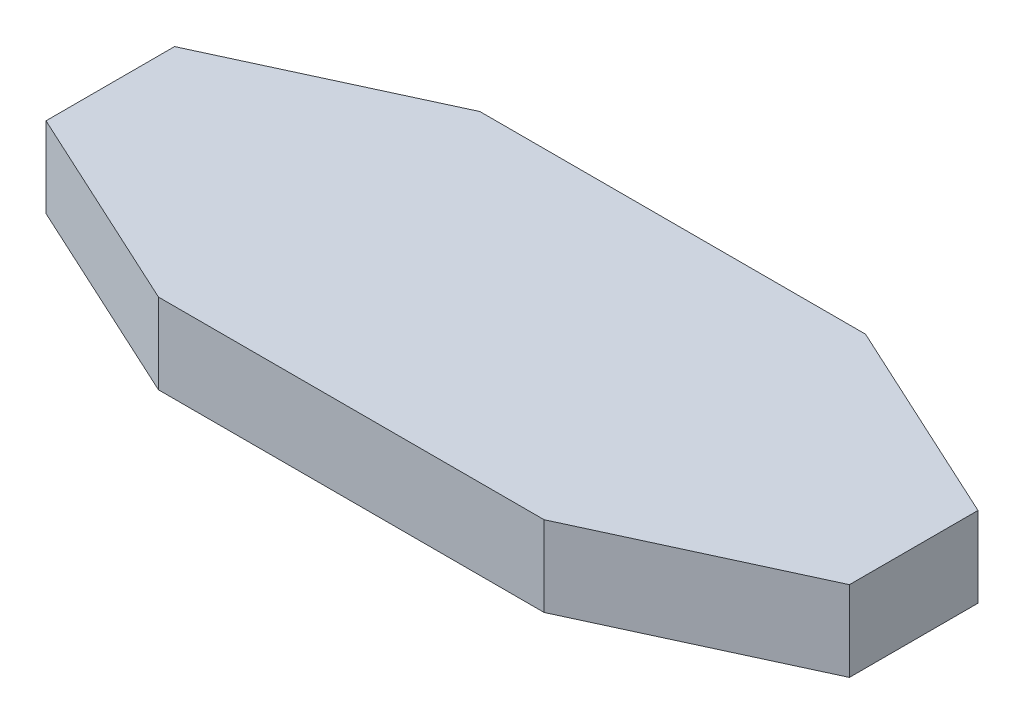
ISO-10303-21;
HEADER;
FILE_DESCRIPTION(('STEP AP214'),'2;1');
FILE_NAME('part.step','',(''),(''),'','','');
FILE_SCHEMA(('AUTOMOTIVE_DESIGN { 1 0 10303 214 1 1 1 1 }'));
ENDSEC;
DATA;
#1=APPLICATION_CONTEXT('core data for automotive mechanical design processes');
#2=APPLICATION_PROTOCOL_DEFINITION('international standard','automotive_design',2000,#1);
#3=PRODUCT_CONTEXT('',#1,'mechanical');
#4=PRODUCT('Part','Part','',(#3));
#5=PRODUCT_RELATED_PRODUCT_CATEGORY('part','',(#4));
#6=PRODUCT_DEFINITION_FORMATION('','',#4);
#7=PRODUCT_DEFINITION_CONTEXT('part definition',#1,'design');
#8=PRODUCT_DEFINITION('design','',#6,#7);
#9=PRODUCT_DEFINITION_SHAPE('','',#8);
#10=(LENGTH_UNIT() NAMED_UNIT(*) SI_UNIT(.MILLI.,.METRE.));
#11=(NAMED_UNIT(*) PLANE_ANGLE_UNIT() SI_UNIT($,.RADIAN.));
#12=(NAMED_UNIT(*) SI_UNIT($,.STERADIAN.) SOLID_ANGLE_UNIT());
#13=UNCERTAINTY_MEASURE_WITH_UNIT(LENGTH_MEASURE(1.E-05),#10,'distance_accuracy_value','');
#14=(GEOMETRIC_REPRESENTATION_CONTEXT(3) GLOBAL_UNCERTAINTY_ASSIGNED_CONTEXT((#13)) GLOBAL_UNIT_ASSIGNED_CONTEXT((#10,
#11,#12)) REPRESENTATION_CONTEXT('',''));
#15=CARTESIAN_POINT('',(0.,0.,0.));
#16=DIRECTION('',(0.,0.,1.));
#17=DIRECTION('',(1.,0.,0.));
#18=AXIS2_PLACEMENT_3D('',#15,#16,#17);
#19=CARTESIAN_POINT('',(-60.,25.,-50.));
#20=DIRECTION('',(0.,0.,-1.));
#21=DIRECTION('',(-1.,0.,0.));
#22=AXIS2_PLACEMENT_3D('',#19,#20,#21);
#23=PLANE('',#22);
#24=DIRECTION('',(1.,0.,0.));
#25=VECTOR('',#24,1.);
#26=CARTESIAN_POINT('',(-60.,0.,-50.));
#27=LINE('',#26,#25);
#28=CARTESIAN_POINT('',(-60.,0.,-50.));
#29=VERTEX_POINT('',#28);
#30=CARTESIAN_POINT('',(60.,0.,-50.));
#31=VERTEX_POINT('',#30);
#32=EDGE_CURVE('E144',#29,#31,#27,.T.);
#33=ORIENTED_EDGE('',*,*,#32,.F.);
#34=DIRECTION('',(0.,-1.,0.));
#35=VECTOR('',#34,1.);
#36=CARTESIAN_POINT('',(-60.,25.,-50.));
#37=LINE('',#36,#35);
#38=CARTESIAN_POINT('',(-60.,25.,-50.));
#39=VERTEX_POINT('',#38);
#40=EDGE_CURVE('E11',#39,#29,#37,.T.);
#41=ORIENTED_EDGE('',*,*,#40,.F.);
#42=DIRECTION('',(1.,0.,0.));
#43=VECTOR('',#42,1.);
#44=CARTESIAN_POINT('',(-60.,25.,-50.));
#45=LINE('',#44,#43);
#46=CARTESIAN_POINT('',(60.,25.,-50.));
#47=VERTEX_POINT('',#46);
#48=EDGE_CURVE('E170',#39,#47,#45,.T.);
#49=ORIENTED_EDGE('',*,*,#48,.T.);
#50=DIRECTION('',(0.,-1.,0.));
#51=VECTOR('',#50,1.);
#52=CARTESIAN_POINT('',(60.,25.,-50.));
#53=LINE('',#52,#51);
#54=EDGE_CURVE('E42',#47,#31,#53,.T.);
#55=ORIENTED_EDGE('',*,*,#54,.T.);
#56=EDGE_LOOP('',(#33,#41,#49,#55));
#57=FACE_BOUND('',#56,.T.);
#58=ADVANCED_FACE('F39',(#57),#23,.T.);
#59=CARTESIAN_POINT('',(-60.,25.,-50.));
#60=DIRECTION('',(0.419058177461748,0.,0.907959384500451));
#61=DIRECTION('',(0.907959384500451,0.,-0.419058177461748));
#62=AXIS2_PLACEMENT_3D('',#59,#60,#61);
#63=PLANE('',#62);
#64=DIRECTION('',(-0.907959384500451,0.,0.419058177461748));
#65=VECTOR('',#64,1.);
#66=CARTESIAN_POINT('',(-60.,0.,-50.));
#67=LINE('',#66,#65);
#68=CARTESIAN_POINT('',(-125.,0.,-19.9999999999999));
#69=VERTEX_POINT('',#68);
#70=EDGE_CURVE('E85',#29,#69,#67,.T.);
#71=ORIENTED_EDGE('',*,*,#70,.T.);
#72=DIRECTION('',(0.,-1.,0.));
#73=VECTOR('',#72,1.);
#74=CARTESIAN_POINT('',(-125.,25.,-19.9999999999999));
#75=LINE('',#74,#73);
#76=CARTESIAN_POINT('',(-125.,25.,-19.9999999999999));
#77=VERTEX_POINT('',#76);
#78=EDGE_CURVE('E49',#77,#69,#75,.T.);
#79=ORIENTED_EDGE('',*,*,#78,.F.);
#80=DIRECTION('',(-0.907959384500451,0.,0.419058177461748));
#81=VECTOR('',#80,1.);
#82=CARTESIAN_POINT('',(-60.,25.,-50.));
#83=LINE('',#82,#81);
#84=EDGE_CURVE('E117',#39,#77,#83,.T.);
#85=ORIENTED_EDGE('',*,*,#84,.F.);
#86=ORIENTED_EDGE('',*,*,#40,.T.);
#87=EDGE_LOOP('',(#71,#79,#85,#86));
#88=FACE_BOUND('',#87,.T.);
#89=ADVANCED_FACE('F217',(#88),#63,.F.);
#90=CARTESIAN_POINT('',(-125.,25.,-19.9999999999999));
#91=DIRECTION('',(1.,0.,0.));
#92=DIRECTION('',(0.,0.,-1.));
#93=AXIS2_PLACEMENT_3D('',#90,#91,#92);
#94=PLANE('',#93);
#95=DIRECTION('',(0.,0.,1.));
#96=VECTOR('',#95,1.);
#97=CARTESIAN_POINT('',(-125.,0.,-19.9999999999999));
#98=LINE('',#97,#96);
#99=CARTESIAN_POINT('',(-125.,0.,20.0000000000001));
#100=VERTEX_POINT('',#99);
#101=EDGE_CURVE('E125',#69,#100,#98,.T.);
#102=ORIENTED_EDGE('',*,*,#101,.T.);
#103=DIRECTION('',(0.,-1.,0.));
#104=VECTOR('',#103,1.);
#105=CARTESIAN_POINT('',(-125.,25.,20.0000000000001));
#106=LINE('',#105,#104);
#107=CARTESIAN_POINT('',(-125.,25.,20.0000000000001));
#108=VERTEX_POINT('',#107);
#109=EDGE_CURVE('E122',#108,#100,#106,.T.);
#110=ORIENTED_EDGE('',*,*,#109,.F.);
#111=DIRECTION('',(0.,0.,1.));
#112=VECTOR('',#111,1.);
#113=CARTESIAN_POINT('',(-125.,25.,-19.9999999999999));
#114=LINE('',#113,#112);
#115=EDGE_CURVE('E109',#77,#108,#114,.T.);
#116=ORIENTED_EDGE('',*,*,#115,.F.);
#117=ORIENTED_EDGE('',*,*,#78,.T.);
#118=EDGE_LOOP('',(#102,#110,#116,#117));
#119=FACE_BOUND('',#118,.T.);
#120=ADVANCED_FACE('F123',(#119),#94,.F.);
#121=CARTESIAN_POINT('',(-125.,25.,20.0000000000001));
#122=DIRECTION('',(0.419058177461746,0.,-0.907959384500452));
#123=DIRECTION('',(-0.907959384500452,0.,-0.419058177461746));
#124=AXIS2_PLACEMENT_3D('',#121,#122,#123);
#125=PLANE('',#124);
#126=DIRECTION('',(0.907959384500452,0.,0.419058177461746));
#127=VECTOR('',#126,1.);
#128=CARTESIAN_POINT('',(-125.,0.,20.0000000000001));
#129=LINE('',#128,#127);
#130=CARTESIAN_POINT('',(-60.,0.,50.));
#131=VERTEX_POINT('',#130);
#132=EDGE_CURVE('E164',#100,#131,#129,.T.);
#133=ORIENTED_EDGE('',*,*,#132,.T.);
#134=DIRECTION('',(0.,-1.,0.));
#135=VECTOR('',#134,1.);
#136=CARTESIAN_POINT('',(-60.,25.,50.));
#137=LINE('',#136,#135);
#138=CARTESIAN_POINT('',(-60.,25.,50.));
#139=VERTEX_POINT('',#138);
#140=EDGE_CURVE('E130',#139,#131,#137,.T.);
#141=ORIENTED_EDGE('',*,*,#140,.F.);
#142=DIRECTION('',(0.907959384500452,0.,0.419058177461746));
#143=VECTOR('',#142,1.);
#144=CARTESIAN_POINT('',(-125.,25.,20.0000000000001));
#145=LINE('',#144,#143);
#146=EDGE_CURVE('E115',#108,#139,#145,.T.);
#147=ORIENTED_EDGE('',*,*,#146,.F.);
#148=ORIENTED_EDGE('',*,*,#109,.T.);
#149=EDGE_LOOP('',(#133,#141,#147,#148));
#150=FACE_BOUND('',#149,.T.);
#151=ADVANCED_FACE('F132',(#150),#125,.F.);
#152=CARTESIAN_POINT('',(60.,25.,50.));
#153=DIRECTION('',(0.,0.,1.));
#154=DIRECTION('',(1.,0.,0.));
#155=AXIS2_PLACEMENT_3D('',#152,#153,#154);
#156=PLANE('',#155);
#157=DIRECTION('',(-1.,0.,0.));
#158=VECTOR('',#157,1.);
#159=CARTESIAN_POINT('',(60.,0.,50.));
#160=LINE('',#159,#158);
#161=CARTESIAN_POINT('',(60.,0.,50.));
#162=VERTEX_POINT('',#161);
#163=EDGE_CURVE('E160',#162,#131,#160,.T.);
#164=ORIENTED_EDGE('',*,*,#163,.F.);
#165=DIRECTION('',(0.,-1.,0.));
#166=VECTOR('',#165,1.);
#167=CARTESIAN_POINT('',(60.,25.,50.));
#168=LINE('',#167,#166);
#169=CARTESIAN_POINT('',(60.,25.,50.));
#170=VERTEX_POINT('',#169);
#171=EDGE_CURVE('E176',#170,#162,#168,.T.);
#172=ORIENTED_EDGE('',*,*,#171,.F.);
#173=DIRECTION('',(-1.,0.,0.));
#174=VECTOR('',#173,1.);
#175=CARTESIAN_POINT('',(60.,25.,50.));
#176=LINE('',#175,#174);
#177=EDGE_CURVE('E135',#170,#139,#176,.T.);
#178=ORIENTED_EDGE('',*,*,#177,.T.);
#179=ORIENTED_EDGE('',*,*,#140,.T.);
#180=EDGE_LOOP('',(#164,#172,#178,#179));
#181=FACE_BOUND('',#180,.T.);
#182=ADVANCED_FACE('F191',(#181),#156,.T.);
#183=CARTESIAN_POINT('',(125.,25.,20.));
#184=DIRECTION('',(0.419058177461747,0.,0.907959384500452));
#185=DIRECTION('',(0.907959384500452,0.,-0.419058177461747));
#186=AXIS2_PLACEMENT_3D('',#183,#184,#185);
#187=PLANE('',#186);
#188=DIRECTION('',(-0.907959384500452,0.,0.419058177461747));
#189=VECTOR('',#188,1.);
#190=CARTESIAN_POINT('',(125.,0.,20.));
#191=LINE('',#190,#189);
#192=CARTESIAN_POINT('',(125.,0.,20.));
#193=VERTEX_POINT('',#192);
#194=EDGE_CURVE('E156',#193,#162,#191,.T.);
#195=ORIENTED_EDGE('',*,*,#194,.F.);
#196=DIRECTION('',(0.,-1.,0.));
#197=VECTOR('',#196,1.);
#198=CARTESIAN_POINT('',(125.,25.,20.));
#199=LINE('',#198,#197);
#200=CARTESIAN_POINT('',(125.,25.,20.));
#201=VERTEX_POINT('',#200);
#202=EDGE_CURVE('E179',#201,#193,#199,.T.);
#203=ORIENTED_EDGE('',*,*,#202,.F.);
#204=DIRECTION('',(-0.907959384500452,0.,0.419058177461747));
#205=VECTOR('',#204,1.);
#206=CARTESIAN_POINT('',(125.,25.,20.));
#207=LINE('',#206,#205);
#208=EDGE_CURVE('E138',#201,#170,#207,.T.);
#209=ORIENTED_EDGE('',*,*,#208,.T.);
#210=ORIENTED_EDGE('',*,*,#171,.T.);
#211=EDGE_LOOP('',(#195,#203,#209,#210));
#212=FACE_BOUND('',#211,.T.);
#213=ADVANCED_FACE('F197',(#212),#187,.T.);
#214=CARTESIAN_POINT('',(125.,25.,-20.));
#215=DIRECTION('',(1.,0.,0.));
#216=DIRECTION('',(0.,0.,-1.));
#217=AXIS2_PLACEMENT_3D('',#214,#215,#216);
#218=PLANE('',#217);
#219=DIRECTION('',(0.,0.,1.));
#220=VECTOR('',#219,1.);
#221=CARTESIAN_POINT('',(125.,0.,-20.));
#222=LINE('',#221,#220);
#223=CARTESIAN_POINT('',(125.,0.,-20.));
#224=VERTEX_POINT('',#223);
#225=EDGE_CURVE('E152',#224,#193,#222,.T.);
#226=ORIENTED_EDGE('',*,*,#225,.F.);
#227=DIRECTION('',(0.,-1.,0.));
#228=VECTOR('',#227,1.);
#229=CARTESIAN_POINT('',(125.,25.,-20.));
#230=LINE('',#229,#228);
#231=CARTESIAN_POINT('',(125.,25.,-20.));
#232=VERTEX_POINT('',#231);
#233=EDGE_CURVE('E181',#232,#224,#230,.T.);
#234=ORIENTED_EDGE('',*,*,#233,.F.);
#235=DIRECTION('',(0.,0.,1.));
#236=VECTOR('',#235,1.);
#237=CARTESIAN_POINT('',(125.,25.,-20.));
#238=LINE('',#237,#236);
#239=EDGE_CURVE('E199',#232,#201,#238,.T.);
#240=ORIENTED_EDGE('',*,*,#239,.T.);
#241=ORIENTED_EDGE('',*,*,#202,.T.);
#242=EDGE_LOOP('',(#226,#234,#240,#241));
#243=FACE_BOUND('',#242,.T.);
#244=ADVANCED_FACE('F208',(#243),#218,.T.);
#245=CARTESIAN_POINT('',(60.,25.,-50.));
#246=DIRECTION('',(0.419058177461748,0.,-0.907959384500451));
#247=DIRECTION('',(-0.907959384500451,0.,-0.419058177461748));
#248=AXIS2_PLACEMENT_3D('',#245,#246,#247);
#249=PLANE('',#248);
#250=DIRECTION('',(0.907959384500451,0.,0.419058177461748));
#251=VECTOR('',#250,1.);
#252=CARTESIAN_POINT('',(60.,0.,-50.));
#253=LINE('',#252,#251);
#254=EDGE_CURVE('E148',#31,#224,#253,.T.);
#255=ORIENTED_EDGE('',*,*,#254,.F.);
#256=ORIENTED_EDGE('',*,*,#54,.F.);
#257=DIRECTION('',(0.907959384500451,0.,0.419058177461748));
#258=VECTOR('',#257,1.);
#259=CARTESIAN_POINT('',(60.,25.,-50.));
#260=LINE('',#259,#258);
#261=EDGE_CURVE('E201',#47,#232,#260,.T.);
#262=ORIENTED_EDGE('',*,*,#261,.T.);
#263=ORIENTED_EDGE('',*,*,#233,.T.);
#264=EDGE_LOOP('',(#255,#256,#262,#263));
#265=FACE_BOUND('',#264,.T.);
#266=ADVANCED_FACE('F185',(#265),#249,.T.);
#267=CARTESIAN_POINT('',(0.,25.,0.));
#268=DIRECTION('',(0.,-1.,0.));
#269=DIRECTION('',(0.,0.,-1.));
#270=AXIS2_PLACEMENT_3D('',#267,#268,#269);
#271=PLANE('',#270);
#272=ORIENTED_EDGE('',*,*,#48,.F.);
#273=ORIENTED_EDGE('',*,*,#84,.T.);
#274=ORIENTED_EDGE('',*,*,#115,.T.);
#275=ORIENTED_EDGE('',*,*,#146,.T.);
#276=ORIENTED_EDGE('',*,*,#177,.F.);
#277=ORIENTED_EDGE('',*,*,#208,.F.);
#278=ORIENTED_EDGE('',*,*,#239,.F.);
#279=ORIENTED_EDGE('',*,*,#261,.F.);
#280=EDGE_LOOP('',(#272,#273,#274,#275,#276,#277,#278,#279));
#281=FACE_BOUND('',#280,.T.);
#282=ADVANCED_FACE('F112',(#281),#271,.F.);
#283=CARTESIAN_POINT('',(0.,0.,0.));
#284=DIRECTION('',(0.,-1.,0.));
#285=DIRECTION('',(0.,0.,-1.));
#286=AXIS2_PLACEMENT_3D('',#283,#284,#285);
#287=PLANE('',#286);
#288=ORIENTED_EDGE('',*,*,#32,.T.);
#289=ORIENTED_EDGE('',*,*,#254,.T.);
#290=ORIENTED_EDGE('',*,*,#225,.T.);
#291=ORIENTED_EDGE('',*,*,#194,.T.);
#292=ORIENTED_EDGE('',*,*,#163,.T.);
#293=ORIENTED_EDGE('',*,*,#132,.F.);
#294=ORIENTED_EDGE('',*,*,#101,.F.);
#295=ORIENTED_EDGE('',*,*,#70,.F.);
#296=EDGE_LOOP('',(#288,#289,#290,#291,#292,#293,#294,#295));
#297=FACE_BOUND('',#296,.T.);
#298=ADVANCED_FACE('F187',(#297),#287,.T.);
#299=CLOSED_SHELL('',(#58,#89,#120,#151,#182,#213,#244,#266,#282,#298));
#300=MANIFOLD_SOLID_BREP('B2',#299);
#301=ADVANCED_BREP_SHAPE_REPRESENTATION('',(#18,#300),#14);
#302=SHAPE_DEFINITION_REPRESENTATION(#9,#301);
ENDSEC;
END-ISO-10303-21;
